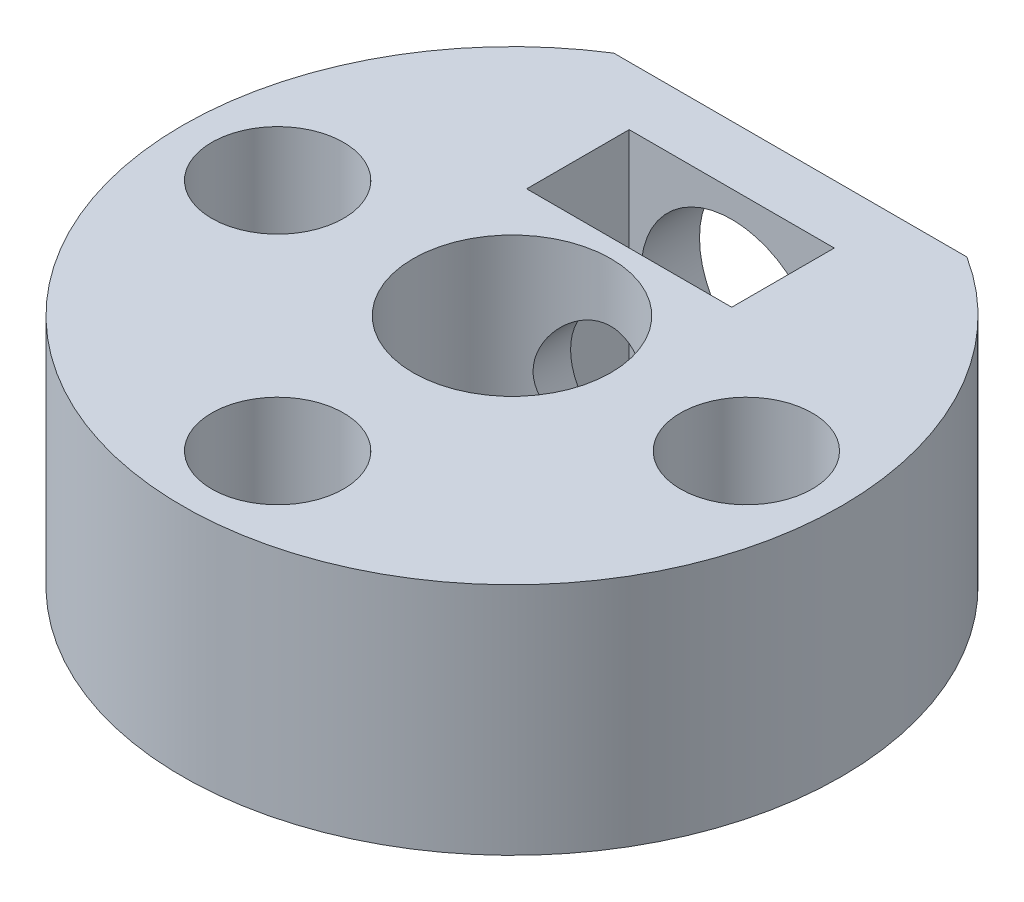
ISO-10303-21;
HEADER;
FILE_DESCRIPTION(('STEP AP214'),'2;1');
FILE_NAME('part.step','',(''),(''),'','','');
FILE_SCHEMA(('AUTOMOTIVE_DESIGN { 1 0 10303 214 1 1 1 1 }'));
ENDSEC;
DATA;
#1=APPLICATION_CONTEXT('core data for automotive mechanical design processes');
#2=APPLICATION_PROTOCOL_DEFINITION('international standard','automotive_design',2000,#1);
#3=PRODUCT_CONTEXT('',#1,'mechanical');
#4=PRODUCT('Part','Part','',(#3));
#5=PRODUCT_RELATED_PRODUCT_CATEGORY('part','',(#4));
#6=PRODUCT_DEFINITION_FORMATION('','',#4);
#7=PRODUCT_DEFINITION_CONTEXT('part definition',#1,'design');
#8=PRODUCT_DEFINITION('design','',#6,#7);
#9=PRODUCT_DEFINITION_SHAPE('','',#8);
#10=(LENGTH_UNIT() NAMED_UNIT(*) SI_UNIT(.MILLI.,.METRE.));
#11=(NAMED_UNIT(*) PLANE_ANGLE_UNIT() SI_UNIT($,.RADIAN.));
#12=(NAMED_UNIT(*) SI_UNIT($,.STERADIAN.) SOLID_ANGLE_UNIT());
#13=UNCERTAINTY_MEASURE_WITH_UNIT(LENGTH_MEASURE(1.E-05),#10,'distance_accuracy_value','');
#14=(GEOMETRIC_REPRESENTATION_CONTEXT(3) GLOBAL_UNCERTAINTY_ASSIGNED_CONTEXT((#13)) GLOBAL_UNIT_ASSIGNED_CONTEXT((#10,
#11,#12)) REPRESENTATION_CONTEXT('',''));
#15=CARTESIAN_POINT('',(0.,0.,0.));
#16=DIRECTION('',(0.,0.,1.));
#17=DIRECTION('',(1.,0.,0.));
#18=AXIS2_PLACEMENT_3D('',#15,#16,#17);
#19=CARTESIAN_POINT('',(0.,8.,0.));
#20=DIRECTION('',(0.,-1.,0.));
#21=DIRECTION('',(0.,0.,-1.));
#22=AXIS2_PLACEMENT_3D('',#19,#20,#21);
#23=CYLINDRICAL_SURFACE('',#22,11.25);
#24=CARTESIAN_POINT('',(0.,0.,0.));
#25=DIRECTION('',(0.,1.,0.));
#26=DIRECTION('',(0.,0.,1.));
#27=AXIS2_PLACEMENT_3D('',#24,#25,#26);
#28=CIRCLE('',#27,11.25);
#29=CARTESIAN_POINT('',(-6.02598539659698,0.,-9.5));
#30=VERTEX_POINT('',#29);
#31=CARTESIAN_POINT('',(6.02598539659698,0.,-9.5));
#32=VERTEX_POINT('',#31);
#33=EDGE_CURVE('E137',#30,#32,#28,.T.);
#34=ORIENTED_EDGE('',*,*,#33,.T.);
#35=DIRECTION('',(0.,-1.,0.));
#36=VECTOR('',#35,1.);
#37=CARTESIAN_POINT('',(6.02598539659698,8.,-9.5));
#38=LINE('',#37,#36);
#39=CARTESIAN_POINT('',(6.02598539659698,8.,-9.5));
#40=VERTEX_POINT('',#39);
#41=EDGE_CURVE('E11',#40,#32,#38,.T.);
#42=ORIENTED_EDGE('',*,*,#41,.F.);
#43=CARTESIAN_POINT('',(0.,8.,0.));
#44=DIRECTION('',(0.,1.,0.));
#45=DIRECTION('',(0.,0.,1.));
#46=AXIS2_PLACEMENT_3D('',#43,#44,#45);
#47=CIRCLE('',#46,11.25);
#48=CARTESIAN_POINT('',(-6.02598539659698,8.,-9.5));
#49=VERTEX_POINT('',#48);
#50=EDGE_CURVE('E140',#49,#40,#47,.T.);
#51=ORIENTED_EDGE('',*,*,#50,.F.);
#52=DIRECTION('',(0.,-1.,0.));
#53=VECTOR('',#52,1.);
#54=CARTESIAN_POINT('',(-6.02598539659698,8.,-9.5));
#55=LINE('',#54,#53);
#56=EDGE_CURVE('E49',#49,#30,#55,.T.);
#57=ORIENTED_EDGE('',*,*,#56,.T.);
#58=EDGE_LOOP('',(#34,#42,#51,#57));
#59=FACE_BOUND('',#58,.T.);
#60=ADVANCED_FACE('F36',(#59),#23,.T.);
#61=CARTESIAN_POINT('',(6.02598539659698,8.,-9.5));
#62=DIRECTION('',(0.,0.,1.));
#63=DIRECTION('',(1.,0.,0.));
#64=AXIS2_PLACEMENT_3D('',#61,#62,#63);
#65=PLANE('',#64);
#66=CARTESIAN_POINT('',(0.,4.,-9.5));
#67=DIRECTION('',(0.,0.,-1.));
#68=DIRECTION('',(-1.,0.,0.));
#69=AXIS2_PLACEMENT_3D('',#66,#67,#68);
#70=CIRCLE('',#69,3.1);
#71=CARTESIAN_POINT('',(-3.1,4.,-9.5));
#72=VERTEX_POINT('',#71);
#73=EDGE_CURVE('E398',#72,#72,#70,.T.);
#74=ORIENTED_EDGE('',*,*,#73,.F.);
#75=EDGE_LOOP('',(#74));
#76=FACE_BOUND('',#75,.T.);
#77=DIRECTION('',(-1.,0.,0.));
#78=VECTOR('',#77,1.);
#79=CARTESIAN_POINT('',(6.02598539659698,0.,-9.5));
#80=LINE('',#79,#78);
#81=EDGE_CURVE('E144',#32,#30,#80,.T.);
#82=ORIENTED_EDGE('',*,*,#81,.T.);
#83=ORIENTED_EDGE('',*,*,#56,.F.);
#84=DIRECTION('',(-1.,0.,0.));
#85=VECTOR('',#84,1.);
#86=CARTESIAN_POINT('',(6.02598539659698,8.,-9.5));
#87=LINE('',#86,#85);
#88=EDGE_CURVE('E143',#40,#49,#87,.T.);
#89=ORIENTED_EDGE('',*,*,#88,.F.);
#90=ORIENTED_EDGE('',*,*,#41,.T.);
#91=EDGE_LOOP('',(#82,#83,#89,#90));
#92=FACE_BOUND('',#91,.T.);
#93=ADVANCED_FACE('F157',(#76,#92),#65,.F.);
#94=CARTESIAN_POINT('',(0.,8.,0.));
#95=DIRECTION('',(0.,1.,0.));
#96=DIRECTION('',(0.,0.,1.));
#97=AXIS2_PLACEMENT_3D('',#94,#95,#96);
#98=PLANE('',#97);
#99=CARTESIAN_POINT('',(-8.,8.,0.));
#100=DIRECTION('',(0.,1.,0.));
#101=DIRECTION('',(0.,0.,1.));
#102=AXIS2_PLACEMENT_3D('',#99,#100,#101);
#103=CIRCLE('',#102,2.25);
#104=CARTESIAN_POINT('',(-8.,8.,2.25));
#105=VERTEX_POINT('',#104);
#106=EDGE_CURVE('E392',#105,#105,#103,.T.);
#107=ORIENTED_EDGE('',*,*,#106,.F.);
#108=EDGE_LOOP('',(#107));
#109=FACE_BOUND('',#108,.T.);
#110=CARTESIAN_POINT('',(0.,8.,8.));
#111=DIRECTION('',(0.,1.,0.));
#112=DIRECTION('',(0.,0.,1.));
#113=AXIS2_PLACEMENT_3D('',#110,#111,#112);
#114=CIRCLE('',#113,2.25);
#115=CARTESIAN_POINT('',(0.,8.,10.25));
#116=VERTEX_POINT('',#115);
#117=EDGE_CURVE('E380',#116,#116,#114,.T.);
#118=ORIENTED_EDGE('',*,*,#117,.F.);
#119=EDGE_LOOP('',(#118));
#120=FACE_BOUND('',#119,.T.);
#121=CARTESIAN_POINT('',(8.,8.,0.));
#122=DIRECTION('',(0.,1.,0.));
#123=DIRECTION('',(0.,0.,1.));
#124=AXIS2_PLACEMENT_3D('',#121,#122,#123);
#125=CIRCLE('',#124,2.25);
#126=CARTESIAN_POINT('',(8.,8.,2.25));
#127=VERTEX_POINT('',#126);
#128=EDGE_CURVE('E366',#127,#127,#125,.T.);
#129=ORIENTED_EDGE('',*,*,#128,.F.);
#130=EDGE_LOOP('',(#129));
#131=FACE_BOUND('',#130,.T.);
#132=DIRECTION('',(0.,0.,-1.));
#133=VECTOR('',#132,1.);
#134=CARTESIAN_POINT('',(3.5,8.,-4.));
#135=LINE('',#134,#133);
#136=CARTESIAN_POINT('',(3.5,8.,-4.));
#137=VERTEX_POINT('',#136);
#138=CARTESIAN_POINT('',(3.5,8.,-7.5));
#139=VERTEX_POINT('',#138);
#140=EDGE_CURVE('E56',#137,#139,#135,.T.);
#141=ORIENTED_EDGE('',*,*,#140,.F.);
#142=DIRECTION('',(1.,0.,0.));
#143=VECTOR('',#142,1.);
#144=CARTESIAN_POINT('',(-3.5,8.,-4.));
#145=LINE('',#144,#143);
#146=CARTESIAN_POINT('',(-3.5,8.,-4.));
#147=VERTEX_POINT('',#146);
#148=EDGE_CURVE('E112',#147,#137,#145,.T.);
#149=ORIENTED_EDGE('',*,*,#148,.F.);
#150=DIRECTION('',(0.,0.,1.));
#151=VECTOR('',#150,1.);
#152=CARTESIAN_POINT('',(-3.5,8.,-4.));
#153=LINE('',#152,#151);
#154=CARTESIAN_POINT('',(-3.5,8.,-7.5));
#155=VERTEX_POINT('',#154);
#156=EDGE_CURVE('E115',#155,#147,#153,.T.);
#157=ORIENTED_EDGE('',*,*,#156,.F.);
#158=DIRECTION('',(-1.,0.,0.));
#159=VECTOR('',#158,1.);
#160=CARTESIAN_POINT('',(-3.5,8.,-7.5));
#161=LINE('',#160,#159);
#162=EDGE_CURVE('E124',#139,#155,#161,.T.);
#163=ORIENTED_EDGE('',*,*,#162,.F.);
#164=EDGE_LOOP('',(#141,#149,#157,#163));
#165=FACE_BOUND('',#164,.T.);
#166=CARTESIAN_POINT('',(0.,8.,0.));
#167=DIRECTION('',(0.,1.,0.));
#168=DIRECTION('',(0.,0.,1.));
#169=AXIS2_PLACEMENT_3D('',#166,#167,#168);
#170=CIRCLE('',#169,3.375);
#171=CARTESIAN_POINT('',(0.,8.,3.375));
#172=VERTEX_POINT('',#171);
#173=EDGE_CURVE('E130',#172,#172,#170,.T.);
#174=ORIENTED_EDGE('',*,*,#173,.F.);
#175=EDGE_LOOP('',(#174));
#176=FACE_BOUND('',#175,.T.);
#177=ORIENTED_EDGE('',*,*,#50,.T.);
#178=ORIENTED_EDGE('',*,*,#88,.T.);
#179=EDGE_LOOP('',(#177,#178));
#180=FACE_BOUND('',#179,.T.);
#181=ADVANCED_FACE('F159',(#109,#120,#131,#165,#176,#180),#98,.T.);
#182=CARTESIAN_POINT('',(0.,0.,0.));
#183=DIRECTION('',(0.,1.,0.));
#184=DIRECTION('',(0.,0.,1.));
#185=AXIS2_PLACEMENT_3D('',#182,#183,#184);
#186=PLANE('',#185);
#187=CARTESIAN_POINT('',(-8.,0.,0.));
#188=DIRECTION('',(0.,1.,0.));
#189=DIRECTION('',(0.,0.,1.));
#190=AXIS2_PLACEMENT_3D('',#187,#188,#189);
#191=CIRCLE('',#190,1.25);
#192=CARTESIAN_POINT('',(-8.,0.,1.25));
#193=VERTEX_POINT('',#192);
#194=EDGE_CURVE('E383',#193,#193,#191,.T.);
#195=ORIENTED_EDGE('',*,*,#194,.T.);
#196=EDGE_LOOP('',(#195));
#197=FACE_BOUND('',#196,.T.);
#198=CARTESIAN_POINT('',(0.,0.,8.));
#199=DIRECTION('',(0.,1.,0.));
#200=DIRECTION('',(0.,0.,1.));
#201=AXIS2_PLACEMENT_3D('',#198,#199,#200);
#202=CIRCLE('',#201,1.25);
#203=CARTESIAN_POINT('',(0.,0.,9.25));
#204=VERTEX_POINT('',#203);
#205=EDGE_CURVE('E371',#204,#204,#202,.T.);
#206=ORIENTED_EDGE('',*,*,#205,.T.);
#207=EDGE_LOOP('',(#206));
#208=FACE_BOUND('',#207,.T.);
#209=CARTESIAN_POINT('',(8.,0.,0.));
#210=DIRECTION('',(0.,1.,0.));
#211=DIRECTION('',(0.,0.,1.));
#212=AXIS2_PLACEMENT_3D('',#209,#210,#211);
#213=CIRCLE('',#212,1.25);
#214=CARTESIAN_POINT('',(8.,0.,1.25));
#215=VERTEX_POINT('',#214);
#216=EDGE_CURVE('E118',#215,#215,#213,.T.);
#217=ORIENTED_EDGE('',*,*,#216,.T.);
#218=EDGE_LOOP('',(#217));
#219=FACE_BOUND('',#218,.T.);
#220=DIRECTION('',(1.,0.,0.));
#221=VECTOR('',#220,1.);
#222=CARTESIAN_POINT('',(-3.5,0.,-4.));
#223=LINE('',#222,#221);
#224=CARTESIAN_POINT('',(-3.5,0.,-4.));
#225=VERTEX_POINT('',#224);
#226=CARTESIAN_POINT('',(3.5,0.,-4.));
#227=VERTEX_POINT('',#226);
#228=EDGE_CURVE('E102',#225,#227,#223,.T.);
#229=ORIENTED_EDGE('',*,*,#228,.T.);
#230=DIRECTION('',(0.,0.,-1.));
#231=VECTOR('',#230,1.);
#232=CARTESIAN_POINT('',(3.5,0.,-4.));
#233=LINE('',#232,#231);
#234=CARTESIAN_POINT('',(3.5,0.,-7.5));
#235=VERTEX_POINT('',#234);
#236=EDGE_CURVE('E96',#227,#235,#233,.T.);
#237=ORIENTED_EDGE('',*,*,#236,.T.);
#238=DIRECTION('',(-1.,0.,0.));
#239=VECTOR('',#238,1.);
#240=CARTESIAN_POINT('',(-3.5,0.,-7.5));
#241=LINE('',#240,#239);
#242=CARTESIAN_POINT('',(-3.5,0.,-7.5));
#243=VERTEX_POINT('',#242);
#244=EDGE_CURVE('E105',#235,#243,#241,.T.);
#245=ORIENTED_EDGE('',*,*,#244,.T.);
#246=DIRECTION('',(0.,0.,1.));
#247=VECTOR('',#246,1.);
#248=CARTESIAN_POINT('',(-3.5,0.,-4.));
#249=LINE('',#248,#247);
#250=EDGE_CURVE('E64',#243,#225,#249,.T.);
#251=ORIENTED_EDGE('',*,*,#250,.T.);
#252=EDGE_LOOP('',(#229,#237,#245,#251));
#253=FACE_BOUND('',#252,.T.);
#254=CARTESIAN_POINT('',(0.,0.,0.));
#255=DIRECTION('',(0.,1.,0.));
#256=DIRECTION('',(0.,0.,1.));
#257=AXIS2_PLACEMENT_3D('',#254,#255,#256);
#258=CIRCLE('',#257,3.375);
#259=CARTESIAN_POINT('',(0.,0.,3.375));
#260=VERTEX_POINT('',#259);
#261=EDGE_CURVE('E134',#260,#260,#258,.T.);
#262=ORIENTED_EDGE('',*,*,#261,.T.);
#263=EDGE_LOOP('',(#262));
#264=FACE_BOUND('',#263,.T.);
#265=ORIENTED_EDGE('',*,*,#33,.F.);
#266=ORIENTED_EDGE('',*,*,#81,.F.);
#267=EDGE_LOOP('',(#265,#266));
#268=FACE_BOUND('',#267,.T.);
#269=ADVANCED_FACE('F109',(#197,#208,#219,#253,#264,#268),#186,.F.);
#270=CARTESIAN_POINT('',(0.,0.,0.));
#271=DIRECTION('',(0.,1.,0.));
#272=DIRECTION('',(0.,0.,1.));
#273=AXIS2_PLACEMENT_3D('',#270,#271,#272);
#274=CYLINDRICAL_SURFACE('',#273,3.375);
#275=CARTESIAN_POINT('',(-2.,4.,-2.71857039636644));
#276=CARTESIAN_POINT('',(-2.00000302005978,4.10093656169047,-2.71856624475387));
#277=CARTESIAN_POINT('',(-1.99231217938209,4.20185789729625,-2.72427590593308));
#278=CARTESIAN_POINT('',(-1.96209936884802,4.40032923373294,-2.74611066877484));
#279=CARTESIAN_POINT('',(-1.93956215340677,4.49787566041339,-2.76224647661076));
#280=CARTESIAN_POINT('',(-1.88113400144247,4.68630386175832,-2.80235424552315));
#281=CARTESIAN_POINT('',(-1.8453367327096,4.77722715496814,-2.82627110109562));
#282=CARTESIAN_POINT('',(-1.76170207463345,4.95172369697022,-2.87914483816479));
#283=CARTESIAN_POINT('',(-1.7138609372636,5.03529464678332,-2.90810328772804));
#284=CARTESIAN_POINT('',(-1.60085999612088,5.2036235604198,-2.97196274924336));
#285=CARTESIAN_POINT('',(-1.53431713506507,5.28734054558201,-3.00716090709141));
#286=CARTESIAN_POINT('',(-1.38863939804685,5.44328669280442,-3.07714884290393));
#287=CARTESIAN_POINT('',(-1.30949545418994,5.5155075066599,-3.11193830726021));
#288=CARTESIAN_POINT('',(-1.13082813326993,5.653868511511,-3.18150341377652));
#289=CARTESIAN_POINT('',(-1.03003952399458,5.71858541775183,-3.21589798040981));
#290=CARTESIAN_POINT('',(-0.816579339803555,5.82965341821226,-3.27659759842655));
#291=CARTESIAN_POINT('',(-0.703918493012731,5.87602091635399,-3.30290987045169));
#292=CARTESIAN_POINT('',(-0.481056838073759,5.94444564525355,-3.34227308082225));
#293=CARTESIAN_POINT('',(-0.371613149432158,5.96837239685891,-3.3563349211567));
#294=CARTESIAN_POINT('',(-0.149452457498916,5.99754372521515,-3.37352322783196));
#295=CARTESIAN_POINT('',(-0.036738525366294,6.00280529265913,-3.37665963941244));
#296=CARTESIAN_POINT('',(0.174054629669656,5.994859391292,-3.37195650209562));
#297=CARTESIAN_POINT('',(0.272253852368319,5.98381039632812,-3.36539957284306));
#298=CARTESIAN_POINT('',(0.465107054066476,5.94763957712779,-3.34420540017995));
#299=CARTESIAN_POINT('',(0.559760770391415,5.92251671239737,-3.32956755934145));
#300=CARTESIAN_POINT('',(0.743821007189801,5.8591066283179,-3.29336042555524));
#301=CARTESIAN_POINT('',(0.833188358010073,5.82073279960987,-3.27174559262747));
#302=CARTESIAN_POINT('',(1.0043358362359,5.73222439697394,-3.22332983745497));
#303=CARTESIAN_POINT('',(1.08611391399774,5.68208665877825,-3.19652752021592));
#304=CARTESIAN_POINT('',(1.25008957379127,5.56480104191742,-3.13630336181635));
#305=CARTESIAN_POINT('',(1.33120076052291,5.4963448488155,-3.10247365624232));
#306=CARTESIAN_POINT('',(1.481471385522,5.34774998765144,-3.03359800740311));
#307=CARTESIAN_POINT('',(1.55061479295524,5.26759591099432,-2.99855050716708));
#308=CARTESIAN_POINT('',(1.68277087523207,5.087262428334,-2.92663119970711));
#309=CARTESIAN_POINT('',(1.74423811625785,4.98584647009265,-2.8899923269836));
#310=CARTESIAN_POINT('',(1.84889893671708,4.7718128611224,-2.82418880602174));
#311=CARTESIAN_POINT('',(1.89212596239425,4.65921618462214,-2.79501051672545));
#312=CARTESIAN_POINT('',(1.94993605264602,4.45407831525546,-2.75486801584028));
#313=CARTESIAN_POINT('',(1.96892617195287,4.36330821045562,-2.74120121569528));
#314=CARTESIAN_POINT('',(1.99412033204843,4.1791514232301,-2.72293296810409));
#315=CARTESIAN_POINT('',(2.00033852732913,4.08576775380235,-2.7183214853469));
#316=CARTESIAN_POINT('',(1.99963237633693,3.89897487056664,-2.71884071272461));
#317=CARTESIAN_POINT('',(1.99269282736926,3.80556575204459,-2.72398269218832));
#318=CARTESIAN_POINT('',(1.9660652963402,3.62151703042022,-2.74325921761662));
#319=CARTESIAN_POINT('',(1.94636742562879,3.53087963272083,-2.75740073874802));
#320=CARTESIAN_POINT('',(1.89513564458556,3.35428662428289,-2.7928563817203));
#321=CARTESIAN_POINT('',(1.86357009296111,3.26834423912425,-2.81418966218189));
#322=CARTESIAN_POINT('',(1.78970733302349,3.10267937766082,-2.86173000398059));
#323=CARTESIAN_POINT('',(1.74740599198254,3.02295931211716,-2.88793894115552));
#324=CARTESIAN_POINT('',(1.64463809558542,2.85706703494325,-2.94786671815241));
#325=CARTESIAN_POINT('',(1.58228204466371,2.77224701794787,-2.98209398058185));
#326=CARTESIAN_POINT('',(1.44513234341638,2.61341518010118,-3.05092036995606));
#327=CARTESIAN_POINT('',(1.37032717129052,2.53941349203342,-3.08551981335088));
#328=CARTESIAN_POINT('',(1.19948295158788,2.39525813152264,-3.15616950946421));
#329=CARTESIAN_POINT('',(1.10196751438476,2.3266699375699,-3.19188351225946));
#330=CARTESIAN_POINT('',(0.894484546234651,2.2071824585684,-3.25611456561532));
#331=CARTESIAN_POINT('',(0.784525869555467,2.15627069909756,-3.28463668764494));
#332=CARTESIAN_POINT('',(0.563831590961332,2.07782733997892,-3.32932663402442));
#333=CARTESIAN_POINT('',(0.453781825306049,2.04882039917497,-3.34626480351807));
#334=CARTESIAN_POINT('',(0.229273760406813,2.00993168406592,-3.36908590715018));
#335=CARTESIAN_POINT('',(0.114820281655922,2.00002957196272,-3.37498059728765));
#336=CARTESIAN_POINT('',(-0.099255647503966,1.99997431825698,-3.37501685514392));
#337=CARTESIAN_POINT('',(-0.198887341704873,2.00743911461743,-3.37057602144284));
#338=CARTESIAN_POINT('',(-0.395201272337012,2.03692456251692,-3.35322935342601));
#339=CARTESIAN_POINT('',(-0.491883438570622,2.05894556020563,-3.34032331780594));
#340=CARTESIAN_POINT('',(-0.678723371390912,2.11617788827633,-3.30739662882226));
#341=CARTESIAN_POINT('',(-0.768941457351292,2.15124068347228,-3.28745621826425));
#342=CARTESIAN_POINT('',(-0.942256748401966,2.23326478535814,-3.24203845635122));
#343=CARTESIAN_POINT('',(-1.0253522737492,2.28022888850743,-3.2165598038717));
#344=CARTESIAN_POINT('',(-1.19184429043909,2.39048484464602,-3.15891055697649));
#345=CARTESIAN_POINT('',(-1.27428108890741,2.45500022670008,-3.12631292077458));
#346=CARTESIAN_POINT('',(-1.42781035598212,2.59564359637172,-3.05925106798505));
#347=CARTESIAN_POINT('',(-1.49888963242232,2.67178489010213,-3.02478474216799));
#348=CARTESIAN_POINT('',(-1.63650357185963,2.84437346006317,-2.95283068130418));
#349=CARTESIAN_POINT('',(-1.70144098002321,2.94216354560416,-2.91548361408817));
#350=CARTESIAN_POINT('',(-1.81387022978564,3.14928015499329,-2.84690192226116));
#351=CARTESIAN_POINT('',(-1.86137699957625,3.25859670338849,-2.81566207798115));
#352=CARTESIAN_POINT('',(-1.93193991697265,3.47216141069209,-2.76764108086213));
#353=CARTESIAN_POINT('',(-1.95730977056216,3.57533562867863,-2.74954088787137));
#354=CARTESIAN_POINT('',(-1.99132342248482,3.78568389411879,-2.72501807210973));
#355=CARTESIAN_POINT('',(-1.99999679404756,3.89285052615124,-2.71857480352174));
#356=CARTESIAN_POINT('',(-2.,4.,-2.71857039636644));
#357=B_SPLINE_CURVE_WITH_KNOTS('',3,(#275,#276,#277,#278,#279,#280,#281,#282,#283,#284,#285,
#286,#287,#288,#289,#290,#291,#292,#293,#294,#295,#296,#297,#298,#299,#300,#301,#302,#303,#304,
#305,#306,#307,#308,#309,#310,#311,#312,#313,#314,#315,#316,#317,#318,#319,#320,#321,#322,#323,
#324,#325,#326,#327,#328,#329,#330,#331,#332,#333,#334,#335,#336,#337,#338,#339,#340,#341,#342,
#343,#344,#345,#346,#347,#348,#349,#350,#351,#352,#353,#354,#355,#356),.UNSPECIFIED.,.T.,.F.,(4,
2,2,2,2,2,2,2,2,2,2,2,2,2,2,2,2,2,2,2,2,2,2,2,2,2,2,2,2,2,2,2,2,2,2,2,2,2,2,2,4),(0.,
0.302360678353001,0.605032332703908,0.905605494553531,1.206272310016,1.54269894028003,
1.87936877069471,2.25120772319724,2.62271350575031,2.95943913016693,3.29585815852415,
3.59155571200407,3.88727512955783,4.18496517010454,4.48273537558908,4.8155985740299,
5.14890424884448,5.51940827976303,5.88922995075223,6.16922925104124,6.44891807414801,
6.72893025169874,7.00915971968349,7.29014168818266,7.57123198481173,7.90203229994899,
8.23314049468283,8.60456188344308,8.9757206213904,9.31884862310958,9.66161115037751,
9.96017274291591,10.2587414355701,10.5540089098362,10.84934582776,11.1769612289252,
11.504954443407,11.8727355647971,12.2402009666078,12.5617427927892,12.8827145700668),.UNSPECIFIED.);
#358=CARTESIAN_POINT('',(-2.,4.,-2.71857039636644));
#359=VERTEX_POINT('',#358);
#360=EDGE_CURVE('E39',#359,#359,#357,.T.);
#361=ORIENTED_EDGE('',*,*,#360,.T.);
#362=EDGE_LOOP('',(#361));
#363=FACE_BOUND('',#362,.T.);
#364=ORIENTED_EDGE('',*,*,#261,.F.);
#365=EDGE_LOOP('',(#364));
#366=FACE_BOUND('',#365,.T.);
#367=ORIENTED_EDGE('',*,*,#173,.T.);
#368=EDGE_LOOP('',(#367));
#369=FACE_BOUND('',#368,.T.);
#370=ADVANCED_FACE('F167',(#363,#366,#369),#274,.F.);
#371=CARTESIAN_POINT('',(3.5,0.,-4.));
#372=DIRECTION('',(1.,0.,0.));
#373=DIRECTION('',(0.,0.,-1.));
#374=AXIS2_PLACEMENT_3D('',#371,#372,#373);
#375=PLANE('',#374);
#376=ORIENTED_EDGE('',*,*,#140,.T.);
#377=DIRECTION('',(0.,1.,0.));
#378=VECTOR('',#377,1.);
#379=CARTESIAN_POINT('',(3.5,0.,-7.5));
#380=LINE('',#379,#378);
#381=EDGE_CURVE('E92',#235,#139,#380,.T.);
#382=ORIENTED_EDGE('',*,*,#381,.F.);
#383=ORIENTED_EDGE('',*,*,#236,.F.);
#384=DIRECTION('',(0.,1.,0.));
#385=VECTOR('',#384,1.);
#386=CARTESIAN_POINT('',(3.5,0.,-4.));
#387=LINE('',#386,#385);
#388=EDGE_CURVE('E128',#227,#137,#387,.T.);
#389=ORIENTED_EDGE('',*,*,#388,.T.);
#390=EDGE_LOOP('',(#376,#382,#383,#389));
#391=FACE_BOUND('',#390,.T.);
#392=ADVANCED_FACE('F94',(#391),#375,.F.);
#393=CARTESIAN_POINT('',(-3.5,0.,-4.));
#394=DIRECTION('',(0.,0.,1.));
#395=DIRECTION('',(1.,0.,0.));
#396=AXIS2_PLACEMENT_3D('',#393,#394,#395);
#397=PLANE('',#396);
#398=CARTESIAN_POINT('',(0.,4.,-4.));
#399=DIRECTION('',(0.,0.,1.));
#400=DIRECTION('',(1.,0.,0.));
#401=AXIS2_PLACEMENT_3D('',#398,#399,#400);
#402=CIRCLE('',#401,2.);
#403=CARTESIAN_POINT('',(2.,4.,-4.));
#404=VERTEX_POINT('',#403);
#405=EDGE_CURVE('E395',#404,#404,#402,.T.);
#406=ORIENTED_EDGE('',*,*,#405,.T.);
#407=EDGE_LOOP('',(#406));
#408=FACE_BOUND('',#407,.T.);
#409=ORIENTED_EDGE('',*,*,#148,.T.);
#410=ORIENTED_EDGE('',*,*,#388,.F.);
#411=ORIENTED_EDGE('',*,*,#228,.F.);
#412=DIRECTION('',(0.,1.,0.));
#413=VECTOR('',#412,1.);
#414=CARTESIAN_POINT('',(-3.5,0.,-4.));
#415=LINE('',#414,#413);
#416=EDGE_CURVE('E131',#225,#147,#415,.T.);
#417=ORIENTED_EDGE('',*,*,#416,.T.);
#418=EDGE_LOOP('',(#409,#410,#411,#417));
#419=FACE_BOUND('',#418,.T.);
#420=ADVANCED_FACE('F204',(#408,#419),#397,.F.);
#421=CARTESIAN_POINT('',(-3.5,0.,-4.));
#422=DIRECTION('',(-1.,0.,0.));
#423=DIRECTION('',(0.,0.,1.));
#424=AXIS2_PLACEMENT_3D('',#421,#422,#423);
#425=PLANE('',#424);
#426=ORIENTED_EDGE('',*,*,#156,.T.);
#427=ORIENTED_EDGE('',*,*,#416,.F.);
#428=ORIENTED_EDGE('',*,*,#250,.F.);
#429=DIRECTION('',(0.,1.,0.));
#430=VECTOR('',#429,1.);
#431=CARTESIAN_POINT('',(-3.5,0.,-7.5));
#432=LINE('',#431,#430);
#433=EDGE_CURVE('E101',#243,#155,#432,.T.);
#434=ORIENTED_EDGE('',*,*,#433,.T.);
#435=EDGE_LOOP('',(#426,#427,#428,#434));
#436=FACE_BOUND('',#435,.T.);
#437=ADVANCED_FACE('F209',(#436),#425,.F.);
#438=CARTESIAN_POINT('',(-3.5,0.,-7.5));
#439=DIRECTION('',(0.,0.,-1.));
#440=DIRECTION('',(-1.,0.,0.));
#441=AXIS2_PLACEMENT_3D('',#438,#439,#440);
#442=PLANE('',#441);
#443=CARTESIAN_POINT('',(0.,4.,-7.5));
#444=DIRECTION('',(0.,0.,-1.));
#445=DIRECTION('',(-1.,0.,0.));
#446=AXIS2_PLACEMENT_3D('',#443,#444,#445);
#447=CIRCLE('',#446,3.1);
#448=CARTESIAN_POINT('',(-3.1,4.,-7.5));
#449=VERTEX_POINT('',#448);
#450=EDGE_CURVE('E401',#449,#449,#447,.T.);
#451=ORIENTED_EDGE('',*,*,#450,.T.);
#452=EDGE_LOOP('',(#451));
#453=FACE_BOUND('',#452,.T.);
#454=ORIENTED_EDGE('',*,*,#162,.T.);
#455=ORIENTED_EDGE('',*,*,#433,.F.);
#456=ORIENTED_EDGE('',*,*,#244,.F.);
#457=ORIENTED_EDGE('',*,*,#381,.T.);
#458=EDGE_LOOP('',(#454,#455,#456,#457));
#459=FACE_BOUND('',#458,.T.);
#460=ADVANCED_FACE('F106',(#453,#459),#442,.F.);
#461=CARTESIAN_POINT('',(8.,8.,0.));
#462=DIRECTION('',(0.,1.,0.));
#463=DIRECTION('',(0.,0.,1.));
#464=AXIS2_PLACEMENT_3D('',#461,#462,#463);
#465=CYLINDRICAL_SURFACE('',#464,1.25);
#466=ORIENTED_EDGE('',*,*,#216,.F.);
#467=EDGE_LOOP('',(#466));
#468=FACE_BOUND('',#467,.T.);
#469=CARTESIAN_POINT('',(8.,2.7,0.));
#470=DIRECTION('',(0.,1.,0.));
#471=DIRECTION('',(0.,0.,1.));
#472=AXIS2_PLACEMENT_3D('',#469,#470,#471);
#473=CIRCLE('',#472,1.25);
#474=CARTESIAN_POINT('',(8.,2.7,1.25));
#475=VERTEX_POINT('',#474);
#476=EDGE_CURVE('E363',#475,#475,#473,.T.);
#477=ORIENTED_EDGE('',*,*,#476,.T.);
#478=EDGE_LOOP('',(#477));
#479=FACE_BOUND('',#478,.T.);
#480=ADVANCED_FACE('F221',(#468,#479),#465,.F.);
#481=CARTESIAN_POINT('',(9.25,2.7,0.));
#482=DIRECTION('',(0.,-1.,0.));
#483=DIRECTION('',(0.,0.,-1.));
#484=AXIS2_PLACEMENT_3D('',#481,#482,#483);
#485=PLANE('',#484);
#486=ORIENTED_EDGE('',*,*,#476,.F.);
#487=EDGE_LOOP('',(#486));
#488=FACE_BOUND('',#487,.T.);
#489=CARTESIAN_POINT('',(8.,2.7,0.));
#490=DIRECTION('',(0.,1.,0.));
#491=DIRECTION('',(0.,0.,1.));
#492=AXIS2_PLACEMENT_3D('',#489,#490,#491);
#493=CIRCLE('',#492,2.25);
#494=CARTESIAN_POINT('',(8.,2.7,2.25));
#495=VERTEX_POINT('',#494);
#496=EDGE_CURVE('E364',#495,#495,#493,.T.);
#497=ORIENTED_EDGE('',*,*,#496,.T.);
#498=EDGE_LOOP('',(#497));
#499=FACE_BOUND('',#498,.T.);
#500=ADVANCED_FACE('F276',(#488,#499),#485,.F.);
#501=CARTESIAN_POINT('',(8.,8.,0.));
#502=DIRECTION('',(0.,1.,0.));
#503=DIRECTION('',(0.,0.,1.));
#504=AXIS2_PLACEMENT_3D('',#501,#502,#503);
#505=CYLINDRICAL_SURFACE('',#504,2.25);
#506=ORIENTED_EDGE('',*,*,#496,.F.);
#507=EDGE_LOOP('',(#506));
#508=FACE_BOUND('',#507,.T.);
#509=ORIENTED_EDGE('',*,*,#128,.T.);
#510=EDGE_LOOP('',(#509));
#511=FACE_BOUND('',#510,.T.);
#512=ADVANCED_FACE('F272',(#508,#511),#505,.F.);
#513=CARTESIAN_POINT('',(0.,8.,8.));
#514=DIRECTION('',(0.,1.,0.));
#515=DIRECTION('',(0.,0.,1.));
#516=AXIS2_PLACEMENT_3D('',#513,#514,#515);
#517=CYLINDRICAL_SURFACE('',#516,1.25);
#518=ORIENTED_EDGE('',*,*,#205,.F.);
#519=EDGE_LOOP('',(#518));
#520=FACE_BOUND('',#519,.T.);
#521=CARTESIAN_POINT('',(0.,2.7,8.));
#522=DIRECTION('',(0.,1.,0.));
#523=DIRECTION('',(0.,0.,1.));
#524=AXIS2_PLACEMENT_3D('',#521,#522,#523);
#525=CIRCLE('',#524,1.25);
#526=CARTESIAN_POINT('',(0.,2.7,9.25));
#527=VERTEX_POINT('',#526);
#528=EDGE_CURVE('E374',#527,#527,#525,.T.);
#529=ORIENTED_EDGE('',*,*,#528,.T.);
#530=EDGE_LOOP('',(#529));
#531=FACE_BOUND('',#530,.T.);
#532=ADVANCED_FACE('F268',(#520,#531),#517,.F.);
#533=CARTESIAN_POINT('',(1.25,2.7,8.));
#534=DIRECTION('',(0.,-1.,0.));
#535=DIRECTION('',(0.,0.,-1.));
#536=AXIS2_PLACEMENT_3D('',#533,#534,#535);
#537=PLANE('',#536);
#538=ORIENTED_EDGE('',*,*,#528,.F.);
#539=EDGE_LOOP('',(#538));
#540=FACE_BOUND('',#539,.T.);
#541=CARTESIAN_POINT('',(0.,2.7,8.));
#542=DIRECTION('',(0.,1.,0.));
#543=DIRECTION('',(0.,0.,1.));
#544=AXIS2_PLACEMENT_3D('',#541,#542,#543);
#545=CIRCLE('',#544,2.25);
#546=CARTESIAN_POINT('',(0.,2.7,10.25));
#547=VERTEX_POINT('',#546);
#548=EDGE_CURVE('E377',#547,#547,#545,.T.);
#549=ORIENTED_EDGE('',*,*,#548,.T.);
#550=EDGE_LOOP('',(#549));
#551=FACE_BOUND('',#550,.T.);
#552=ADVANCED_FACE('F264',(#540,#551),#537,.F.);
#553=CARTESIAN_POINT('',(0.,8.,8.));
#554=DIRECTION('',(0.,1.,0.));
#555=DIRECTION('',(0.,0.,1.));
#556=AXIS2_PLACEMENT_3D('',#553,#554,#555);
#557=CYLINDRICAL_SURFACE('',#556,2.25);
#558=ORIENTED_EDGE('',*,*,#548,.F.);
#559=EDGE_LOOP('',(#558));
#560=FACE_BOUND('',#559,.T.);
#561=ORIENTED_EDGE('',*,*,#117,.T.);
#562=EDGE_LOOP('',(#561));
#563=FACE_BOUND('',#562,.T.);
#564=ADVANCED_FACE('F260',(#560,#563),#557,.F.);
#565=CARTESIAN_POINT('',(-8.,8.,0.));
#566=DIRECTION('',(0.,1.,0.));
#567=DIRECTION('',(0.,0.,1.));
#568=AXIS2_PLACEMENT_3D('',#565,#566,#567);
#569=CYLINDRICAL_SURFACE('',#568,1.25);
#570=ORIENTED_EDGE('',*,*,#194,.F.);
#571=EDGE_LOOP('',(#570));
#572=FACE_BOUND('',#571,.T.);
#573=CARTESIAN_POINT('',(-8.,2.7,0.));
#574=DIRECTION('',(0.,1.,0.));
#575=DIRECTION('',(0.,0.,1.));
#576=AXIS2_PLACEMENT_3D('',#573,#574,#575);
#577=CIRCLE('',#576,1.25);
#578=CARTESIAN_POINT('',(-8.,2.7,1.25));
#579=VERTEX_POINT('',#578);
#580=EDGE_CURVE('E386',#579,#579,#577,.T.);
#581=ORIENTED_EDGE('',*,*,#580,.T.);
#582=EDGE_LOOP('',(#581));
#583=FACE_BOUND('',#582,.T.);
#584=ADVANCED_FACE('F256',(#572,#583),#569,.F.);
#585=CARTESIAN_POINT('',(-6.75,2.7,0.));
#586=DIRECTION('',(0.,-1.,0.));
#587=DIRECTION('',(0.,0.,-1.));
#588=AXIS2_PLACEMENT_3D('',#585,#586,#587);
#589=PLANE('',#588);
#590=ORIENTED_EDGE('',*,*,#580,.F.);
#591=EDGE_LOOP('',(#590));
#592=FACE_BOUND('',#591,.T.);
#593=CARTESIAN_POINT('',(-8.,2.7,0.));
#594=DIRECTION('',(0.,1.,0.));
#595=DIRECTION('',(0.,0.,1.));
#596=AXIS2_PLACEMENT_3D('',#593,#594,#595);
#597=CIRCLE('',#596,2.25);
#598=CARTESIAN_POINT('',(-8.,2.7,2.25));
#599=VERTEX_POINT('',#598);
#600=EDGE_CURVE('E389',#599,#599,#597,.T.);
#601=ORIENTED_EDGE('',*,*,#600,.T.);
#602=EDGE_LOOP('',(#601));
#603=FACE_BOUND('',#602,.T.);
#604=ADVANCED_FACE('F252',(#592,#603),#589,.F.);
#605=CARTESIAN_POINT('',(-8.,8.,0.));
#606=DIRECTION('',(0.,1.,0.));
#607=DIRECTION('',(0.,0.,1.));
#608=AXIS2_PLACEMENT_3D('',#605,#606,#607);
#609=CYLINDRICAL_SURFACE('',#608,2.25);
#610=ORIENTED_EDGE('',*,*,#600,.F.);
#611=EDGE_LOOP('',(#610));
#612=FACE_BOUND('',#611,.T.);
#613=ORIENTED_EDGE('',*,*,#106,.T.);
#614=EDGE_LOOP('',(#613));
#615=FACE_BOUND('',#614,.T.);
#616=ADVANCED_FACE('F188',(#612,#615),#609,.F.);
#617=CARTESIAN_POINT('',(0.,4.,-9.5));
#618=DIRECTION('',(0.,0.,-1.));
#619=DIRECTION('',(-1.,0.,0.));
#620=AXIS2_PLACEMENT_3D('',#617,#618,#619);
#621=CYLINDRICAL_SURFACE('',#620,2.);
#622=ORIENTED_EDGE('',*,*,#360,.F.);
#623=EDGE_LOOP('',(#622));
#624=FACE_BOUND('',#623,.T.);
#625=ORIENTED_EDGE('',*,*,#405,.F.);
#626=EDGE_LOOP('',(#625));
#627=FACE_BOUND('',#626,.T.);
#628=ADVANCED_FACE('F229',(#624,#627),#621,.F.);
#629=CARTESIAN_POINT('',(0.,4.,-9.5));
#630=DIRECTION('',(0.,0.,-1.));
#631=DIRECTION('',(-1.,0.,0.));
#632=AXIS2_PLACEMENT_3D('',#629,#630,#631);
#633=CYLINDRICAL_SURFACE('',#632,3.1);
#634=ORIENTED_EDGE('',*,*,#450,.F.);
#635=EDGE_LOOP('',(#634));
#636=FACE_BOUND('',#635,.T.);
#637=ORIENTED_EDGE('',*,*,#73,.T.);
#638=EDGE_LOOP('',(#637));
#639=FACE_BOUND('',#638,.T.);
#640=ADVANCED_FACE('F234',(#636,#639),#633,.F.);
#641=CLOSED_SHELL('',(#60,#93,#181,#269,#370,#392,#420,#437,#460,#480,#500,#512,#532,#552,#564,
#584,#604,#616,#628,#640));
#642=MANIFOLD_SOLID_BREP('B2',#641);
#643=ADVANCED_BREP_SHAPE_REPRESENTATION('',(#18,#642),#14);
#644=SHAPE_DEFINITION_REPRESENTATION(#9,#643);
ENDSEC;
END-ISO-10303-21;
